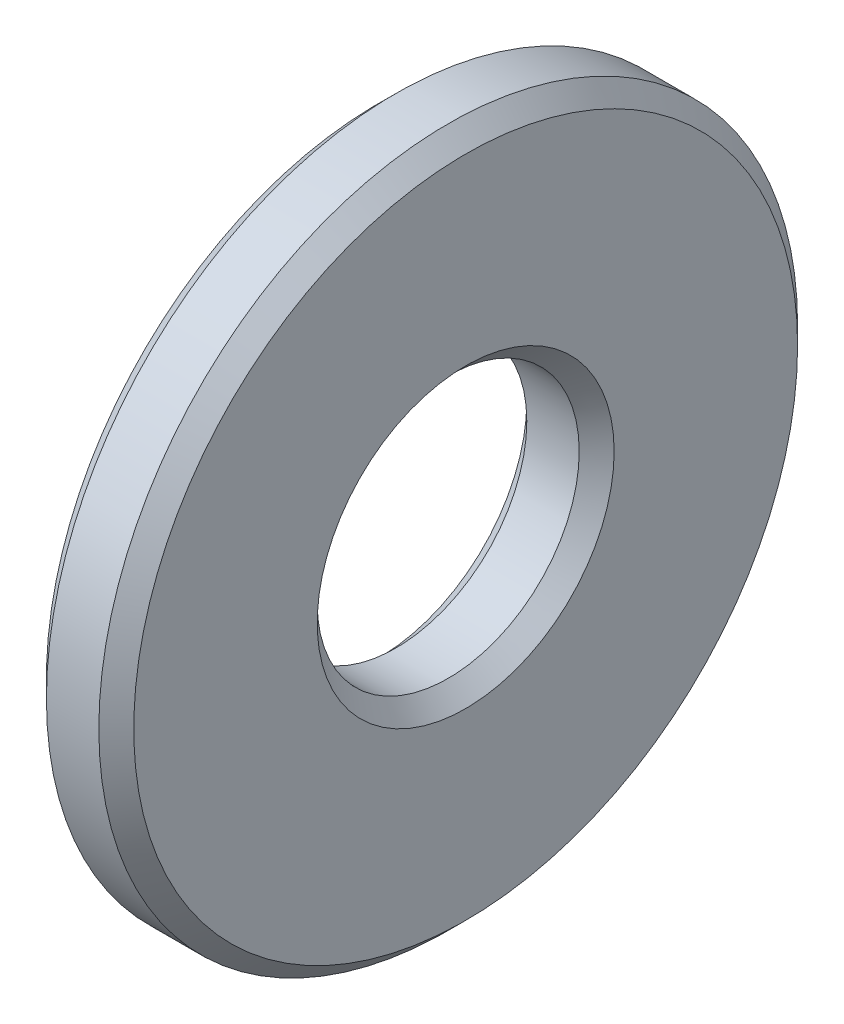
ISO-10303-21;
HEADER;
FILE_DESCRIPTION(('STEP AP214'),'2;1');
FILE_NAME('part.step','',(''),(''),'','','');
FILE_SCHEMA(('AUTOMOTIVE_DESIGN { 1 0 10303 214 1 1 1 1 }'));
ENDSEC;
DATA;
#1=APPLICATION_CONTEXT('core data for automotive mechanical design processes');
#2=APPLICATION_PROTOCOL_DEFINITION('international standard','automotive_design',2000,#1);
#3=PRODUCT_CONTEXT('',#1,'mechanical');
#4=PRODUCT('Part','Part','',(#3));
#5=PRODUCT_RELATED_PRODUCT_CATEGORY('part','',(#4));
#6=PRODUCT_DEFINITION_FORMATION('','',#4);
#7=PRODUCT_DEFINITION_CONTEXT('part definition',#1,'design');
#8=PRODUCT_DEFINITION('design','',#6,#7);
#9=PRODUCT_DEFINITION_SHAPE('','',#8);
#10=(LENGTH_UNIT() NAMED_UNIT(*) SI_UNIT(.MILLI.,.METRE.));
#11=(NAMED_UNIT(*) PLANE_ANGLE_UNIT() SI_UNIT($,.RADIAN.));
#12=(NAMED_UNIT(*) SI_UNIT($,.STERADIAN.) SOLID_ANGLE_UNIT());
#13=UNCERTAINTY_MEASURE_WITH_UNIT(LENGTH_MEASURE(1.E-05),#10,'distance_accuracy_value','');
#14=(GEOMETRIC_REPRESENTATION_CONTEXT(3) GLOBAL_UNCERTAINTY_ASSIGNED_CONTEXT((#13)) GLOBAL_UNIT_ASSIGNED_CONTEXT((#10,
#11,#12)) REPRESENTATION_CONTEXT('',''));
#15=CARTESIAN_POINT('',(0.,0.,0.));
#16=DIRECTION('',(0.,0.,1.));
#17=DIRECTION('',(1.,0.,0.));
#18=AXIS2_PLACEMENT_3D('',#15,#16,#17);
#19=CARTESIAN_POINT('',(0.2,0.,0.));
#20=DIRECTION('',(1.,0.,0.));
#21=DIRECTION('',(0.,0.,-1.));
#22=AXIS2_PLACEMENT_3D('',#19,#20,#21);
#23=CONICAL_SURFACE('',#22,4.,0.785398163397449);
#24=CARTESIAN_POINT('',(0.,0.,0.));
#25=DIRECTION('',(1.,0.,0.));
#26=DIRECTION('',(0.,0.,-1.));
#27=AXIS2_PLACEMENT_3D('',#24,#25,#26);
#28=CIRCLE('',#27,3.8);
#29=CARTESIAN_POINT('',(0.,0.,-3.8));
#30=VERTEX_POINT('',#29);
#31=EDGE_CURVE('E10',#30,#30,#28,.T.);
#32=ORIENTED_EDGE('',*,*,#31,.T.);
#33=EDGE_LOOP('',(#32));
#34=FACE_BOUND('',#33,.T.);
#35=CARTESIAN_POINT('',(0.2,0.,0.));
#36=DIRECTION('',(1.,0.,0.));
#37=DIRECTION('',(0.,0.,-1.));
#38=AXIS2_PLACEMENT_3D('',#35,#36,#37);
#39=CIRCLE('',#38,4.);
#40=CARTESIAN_POINT('',(0.2,0.,-4.));
#41=VERTEX_POINT('',#40);
#42=EDGE_CURVE('E59',#41,#41,#39,.T.);
#43=ORIENTED_EDGE('',*,*,#42,.F.);
#44=EDGE_LOOP('',(#43));
#45=FACE_BOUND('',#44,.T.);
#46=ADVANCED_FACE('F31',(#34,#45),#23,.T.);
#47=CARTESIAN_POINT('',(0.,3.8,0.));
#48=DIRECTION('',(-1.,0.,0.));
#49=DIRECTION('',(0.,0.,1.));
#50=AXIS2_PLACEMENT_3D('',#47,#48,#49);
#51=PLANE('',#50);
#52=CARTESIAN_POINT('',(0.,0.,0.));
#53=DIRECTION('',(1.,0.,0.));
#54=DIRECTION('',(0.,0.,-1.));
#55=AXIS2_PLACEMENT_3D('',#52,#53,#54);
#56=CIRCLE('',#55,1.7);
#57=CARTESIAN_POINT('',(0.,0.,-1.7));
#58=VERTEX_POINT('',#57);
#59=EDGE_CURVE('E37',#58,#58,#56,.T.);
#60=ORIENTED_EDGE('',*,*,#59,.T.);
#61=EDGE_LOOP('',(#60));
#62=FACE_BOUND('',#61,.T.);
#63=ORIENTED_EDGE('',*,*,#31,.F.);
#64=EDGE_LOOP('',(#63));
#65=FACE_BOUND('',#64,.T.);
#66=ADVANCED_FACE('F67',(#62,#65),#51,.T.);
#67=CARTESIAN_POINT('',(0.,0.,0.));
#68=DIRECTION('',(-1.,0.,0.));
#69=DIRECTION('',(0.,0.,1.));
#70=AXIS2_PLACEMENT_3D('',#67,#68,#69);
#71=CONICAL_SURFACE('',#70,1.7,0.785398163397448);
#72=CARTESIAN_POINT('',(0.2,0.,0.));
#73=DIRECTION('',(1.,0.,0.));
#74=DIRECTION('',(0.,0.,-1.));
#75=AXIS2_PLACEMENT_3D('',#72,#73,#74);
#76=CIRCLE('',#75,1.5);
#77=CARTESIAN_POINT('',(0.2,0.,-1.5));
#78=VERTEX_POINT('',#77);
#79=EDGE_CURVE('E41',#78,#78,#76,.T.);
#80=ORIENTED_EDGE('',*,*,#79,.T.);
#81=EDGE_LOOP('',(#80));
#82=FACE_BOUND('',#81,.T.);
#83=ORIENTED_EDGE('',*,*,#59,.F.);
#84=EDGE_LOOP('',(#83));
#85=FACE_BOUND('',#84,.T.);
#86=ADVANCED_FACE('F71',(#82,#85),#71,.F.);
#87=CARTESIAN_POINT('',(0.,0.,0.));
#88=DIRECTION('',(1.,0.,0.));
#89=DIRECTION('',(0.,0.,-1.));
#90=AXIS2_PLACEMENT_3D('',#87,#88,#89);
#91=CYLINDRICAL_SURFACE('',#90,1.5);
#92=CARTESIAN_POINT('',(0.8,0.,0.));
#93=DIRECTION('',(1.,0.,0.));
#94=DIRECTION('',(0.,0.,-1.));
#95=AXIS2_PLACEMENT_3D('',#92,#93,#94);
#96=CIRCLE('',#95,1.5);
#97=CARTESIAN_POINT('',(0.8,0.,-1.5));
#98=VERTEX_POINT('',#97);
#99=EDGE_CURVE('E45',#98,#98,#96,.T.);
#100=ORIENTED_EDGE('',*,*,#99,.T.);
#101=EDGE_LOOP('',(#100));
#102=FACE_BOUND('',#101,.T.);
#103=ORIENTED_EDGE('',*,*,#79,.F.);
#104=EDGE_LOOP('',(#103));
#105=FACE_BOUND('',#104,.T.);
#106=ADVANCED_FACE('F75',(#102,#105),#91,.F.);
#107=CARTESIAN_POINT('',(0.8,0.,0.));
#108=DIRECTION('',(1.,0.,0.));
#109=DIRECTION('',(0.,0.,-1.));
#110=AXIS2_PLACEMENT_3D('',#107,#108,#109);
#111=CONICAL_SURFACE('',#110,1.5,0.785398163397447);
#112=CARTESIAN_POINT('',(1.,0.,0.));
#113=DIRECTION('',(1.,0.,0.));
#114=DIRECTION('',(0.,0.,-1.));
#115=AXIS2_PLACEMENT_3D('',#112,#113,#114);
#116=CIRCLE('',#115,1.7);
#117=CARTESIAN_POINT('',(1.,0.,-1.7));
#118=VERTEX_POINT('',#117);
#119=EDGE_CURVE('E50',#118,#118,#116,.T.);
#120=ORIENTED_EDGE('',*,*,#119,.T.);
#121=EDGE_LOOP('',(#120));
#122=FACE_BOUND('',#121,.T.);
#123=ORIENTED_EDGE('',*,*,#99,.F.);
#124=EDGE_LOOP('',(#123));
#125=FACE_BOUND('',#124,.T.);
#126=ADVANCED_FACE('F82',(#122,#125),#111,.F.);
#127=CARTESIAN_POINT('',(1.,1.7,0.));
#128=DIRECTION('',(1.,0.,0.));
#129=DIRECTION('',(0.,0.,-1.));
#130=AXIS2_PLACEMENT_3D('',#127,#128,#129);
#131=PLANE('',#130);
#132=CARTESIAN_POINT('',(1.,0.,0.));
#133=DIRECTION('',(1.,0.,0.));
#134=DIRECTION('',(0.,0.,-1.));
#135=AXIS2_PLACEMENT_3D('',#132,#133,#134);
#136=CIRCLE('',#135,3.8);
#137=CARTESIAN_POINT('',(1.,0.,-3.8));
#138=VERTEX_POINT('',#137);
#139=EDGE_CURVE('E53',#138,#138,#136,.T.);
#140=ORIENTED_EDGE('',*,*,#139,.T.);
#141=EDGE_LOOP('',(#140));
#142=FACE_BOUND('',#141,.T.);
#143=ORIENTED_EDGE('',*,*,#119,.F.);
#144=EDGE_LOOP('',(#143));
#145=FACE_BOUND('',#144,.T.);
#146=ADVANCED_FACE('F86',(#142,#145),#131,.T.);
#147=CARTESIAN_POINT('',(1.,0.,0.));
#148=DIRECTION('',(-1.,0.,0.));
#149=DIRECTION('',(0.,0.,1.));
#150=AXIS2_PLACEMENT_3D('',#147,#148,#149);
#151=CONICAL_SURFACE('',#150,3.8,0.785398163397446);
#152=CARTESIAN_POINT('',(0.8,0.,0.));
#153=DIRECTION('',(1.,0.,0.));
#154=DIRECTION('',(0.,0.,-1.));
#155=AXIS2_PLACEMENT_3D('',#152,#153,#154);
#156=CIRCLE('',#155,4.);
#157=CARTESIAN_POINT('',(0.8,0.,-4.));
#158=VERTEX_POINT('',#157);
#159=EDGE_CURVE('E56',#158,#158,#156,.T.);
#160=ORIENTED_EDGE('',*,*,#159,.T.);
#161=EDGE_LOOP('',(#160));
#162=FACE_BOUND('',#161,.T.);
#163=ORIENTED_EDGE('',*,*,#139,.F.);
#164=EDGE_LOOP('',(#163));
#165=FACE_BOUND('',#164,.T.);
#166=ADVANCED_FACE('F90',(#162,#165),#151,.T.);
#167=CARTESIAN_POINT('',(0.,0.,0.));
#168=DIRECTION('',(1.,0.,0.));
#169=DIRECTION('',(0.,0.,-1.));
#170=AXIS2_PLACEMENT_3D('',#167,#168,#169);
#171=CYLINDRICAL_SURFACE('',#170,4.);
#172=ORIENTED_EDGE('',*,*,#42,.T.);
#173=EDGE_LOOP('',(#172));
#174=FACE_BOUND('',#173,.T.);
#175=ORIENTED_EDGE('',*,*,#159,.F.);
#176=EDGE_LOOP('',(#175));
#177=FACE_BOUND('',#176,.T.);
#178=ADVANCED_FACE('F63',(#174,#177),#171,.T.);
#179=CLOSED_SHELL('',(#46,#66,#86,#106,#126,#146,#166,#178));
#180=MANIFOLD_SOLID_BREP('B2',#179);
#181=ADVANCED_BREP_SHAPE_REPRESENTATION('',(#18,#180),#14);
#182=SHAPE_DEFINITION_REPRESENTATION(#9,#181);
ENDSEC;
END-ISO-10303-21;
